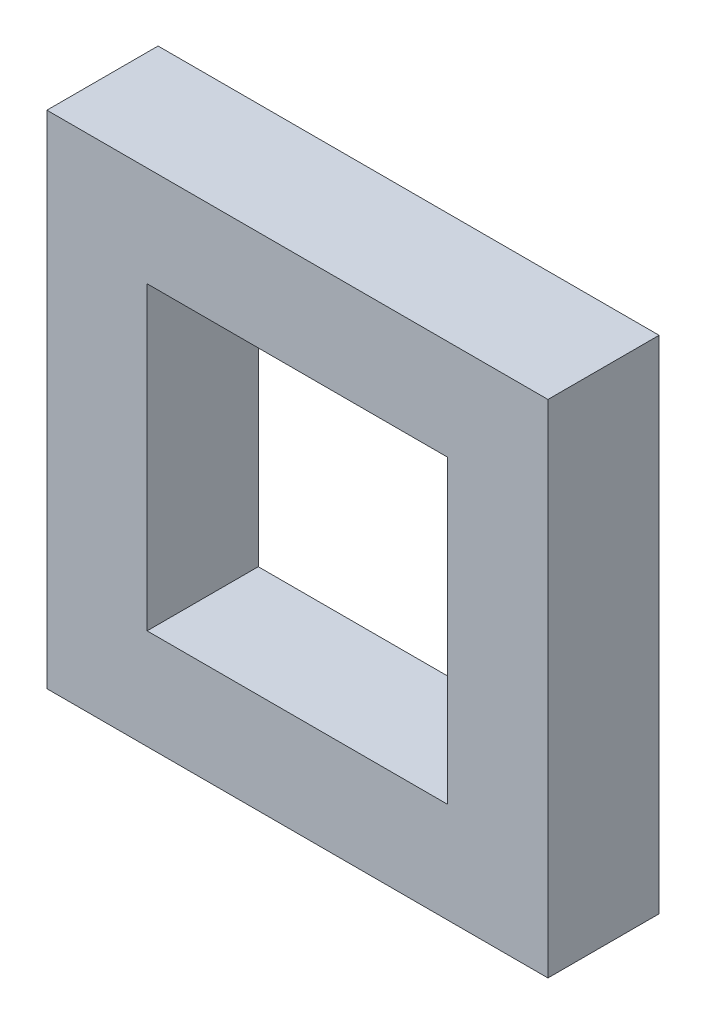
ISO-10303-21;
HEADER;
FILE_DESCRIPTION(('STEP AP214'),'2;1');
FILE_NAME('part.step','',(''),(''),'','','');
FILE_SCHEMA(('AUTOMOTIVE_DESIGN { 1 0 10303 214 1 1 1 1 }'));
ENDSEC;
DATA;
#1=APPLICATION_CONTEXT('core data for automotive mechanical design processes');
#2=APPLICATION_PROTOCOL_DEFINITION('international standard','automotive_design',2000,#1);
#3=PRODUCT_CONTEXT('',#1,'mechanical');
#4=PRODUCT('Part','Part','',(#3));
#5=PRODUCT_RELATED_PRODUCT_CATEGORY('part','',(#4));
#6=PRODUCT_DEFINITION_FORMATION('','',#4);
#7=PRODUCT_DEFINITION_CONTEXT('part definition',#1,'design');
#8=PRODUCT_DEFINITION('design','',#6,#7);
#9=PRODUCT_DEFINITION_SHAPE('','',#8);
#10=(LENGTH_UNIT() NAMED_UNIT(*) SI_UNIT(.MILLI.,.METRE.));
#11=(NAMED_UNIT(*) PLANE_ANGLE_UNIT() SI_UNIT($,.RADIAN.));
#12=(NAMED_UNIT(*) SI_UNIT($,.STERADIAN.) SOLID_ANGLE_UNIT());
#13=UNCERTAINTY_MEASURE_WITH_UNIT(LENGTH_MEASURE(1.E-05),#10,'distance_accuracy_value','');
#14=(GEOMETRIC_REPRESENTATION_CONTEXT(3) GLOBAL_UNCERTAINTY_ASSIGNED_CONTEXT((#13)) GLOBAL_UNIT_ASSIGNED_CONTEXT((#10,
#11,#12)) REPRESENTATION_CONTEXT('',''));
#15=CARTESIAN_POINT('',(0.,0.,0.));
#16=DIRECTION('',(0.,0.,1.));
#17=DIRECTION('',(1.,0.,0.));
#18=AXIS2_PLACEMENT_3D('',#15,#16,#17);
#19=CARTESIAN_POINT('',(0.396687201262181,9.82153319179582,0.15));
#20=DIRECTION('',(0.,-1.,0.));
#21=DIRECTION('',(0.,0.,-1.));
#22=AXIS2_PLACEMENT_3D('',#19,#20,#21);
#23=PLANE('',#22);
#24=DIRECTION('',(1.,0.,0.));
#25=VECTOR('',#24,1.);
#26=CARTESIAN_POINT('',(0.396687201262181,9.82153319179582,0.15));
#27=LINE('',#26,#25);
#28=CARTESIAN_POINT('',(0.396687201262181,9.82153319179582,0.15));
#29=VERTEX_POINT('',#28);
#30=CARTESIAN_POINT('',(0.694202602208818,9.82153319179582,0.15));
#31=VERTEX_POINT('',#30);
#32=EDGE_CURVE('E130',#29,#31,#27,.T.);
#33=ORIENTED_EDGE('',*,*,#32,.T.);
#34=DIRECTION('',(0.,0.,1.));
#35=VECTOR('',#34,1.);
#36=CARTESIAN_POINT('',(0.694202602208818,9.82153319179582,0.15));
#37=LINE('',#36,#35);
#38=CARTESIAN_POINT('',(0.694202602208818,9.82153319179582,0.26));
#39=VERTEX_POINT('',#38);
#40=EDGE_CURVE('E91',#31,#39,#37,.T.);
#41=ORIENTED_EDGE('',*,*,#40,.T.);
#42=DIRECTION('',(1.,0.,0.));
#43=VECTOR('',#42,1.);
#44=CARTESIAN_POINT('',(0.396687201262181,9.82153319179582,0.26));
#45=LINE('',#44,#43);
#46=CARTESIAN_POINT('',(0.396687201262181,9.82153319179582,0.26));
#47=VERTEX_POINT('',#46);
#48=EDGE_CURVE('E11',#47,#39,#45,.T.);
#49=ORIENTED_EDGE('',*,*,#48,.F.);
#50=DIRECTION('',(0.,0.,1.));
#51=VECTOR('',#50,1.);
#52=CARTESIAN_POINT('',(0.396687201262181,9.82153319179582,0.15));
#53=LINE('',#52,#51);
#54=EDGE_CURVE('E88',#29,#47,#53,.T.);
#55=ORIENTED_EDGE('',*,*,#54,.F.);
#56=EDGE_LOOP('',(#33,#41,#49,#55));
#57=FACE_BOUND('',#56,.T.);
#58=ADVANCED_FACE('F16',(#57),#23,.T.);
#59=CARTESIAN_POINT('',(0.5454449017355,9.6727754913225,0.26));
#60=DIRECTION('',(0.,0.,1.));
#61=DIRECTION('',(1.,0.,0.));
#62=AXIS2_PLACEMENT_3D('',#59,#60,#61);
#63=PLANE('',#62);
#64=DIRECTION('',(-1.,0.,0.));
#65=VECTOR('',#64,1.);
#66=CARTESIAN_POINT('',(0.694202602208818,9.52401779084918,0.26));
#67=LINE('',#66,#65);
#68=CARTESIAN_POINT('',(0.694202602208818,9.52401779084918,0.26));
#69=VERTEX_POINT('',#68);
#70=CARTESIAN_POINT('',(0.396687201262181,9.52401779084918,0.26));
#71=VERTEX_POINT('',#70);
#72=EDGE_CURVE('E98',#69,#71,#67,.T.);
#73=ORIENTED_EDGE('',*,*,#72,.T.);
#74=DIRECTION('',(0.,1.,0.));
#75=VECTOR('',#74,1.);
#76=CARTESIAN_POINT('',(0.396687201262181,9.52401779084918,0.26));
#77=LINE('',#76,#75);
#78=EDGE_CURVE('E96',#71,#47,#77,.T.);
#79=ORIENTED_EDGE('',*,*,#78,.T.);
#80=ORIENTED_EDGE('',*,*,#48,.T.);
#81=DIRECTION('',(0.,-1.,0.));
#82=VECTOR('',#81,1.);
#83=CARTESIAN_POINT('',(0.694202602208818,9.82153319179582,0.26));
#84=LINE('',#83,#82);
#85=EDGE_CURVE('E163',#39,#69,#84,.T.);
#86=ORIENTED_EDGE('',*,*,#85,.T.);
#87=EDGE_LOOP('',(#73,#79,#80,#86));
#88=FACE_BOUND('',#87,.T.);
#89=DIRECTION('',(-1.,0.,0.));
#90=VECTOR('',#89,1.);
#91=CARTESIAN_POINT('',(0.297515400946636,9.92070499211137,0.26));
#92=LINE('',#91,#90);
#93=CARTESIAN_POINT('',(0.793374402524363,9.92070499211137,0.26));
#94=VERTEX_POINT('',#93);
#95=CARTESIAN_POINT('',(0.297515400946636,9.92070499211137,0.26));
#96=VERTEX_POINT('',#95);
#97=EDGE_CURVE('E27',#94,#96,#92,.T.);
#98=ORIENTED_EDGE('',*,*,#97,.T.);
#99=DIRECTION('',(0.,-1.,0.));
#100=VECTOR('',#99,1.);
#101=CARTESIAN_POINT('',(0.297515400946636,9.42484599053364,0.26));
#102=LINE('',#101,#100);
#103=CARTESIAN_POINT('',(0.297515400946636,9.42484599053364,0.26));
#104=VERTEX_POINT('',#103);
#105=EDGE_CURVE('E154',#96,#104,#102,.T.);
#106=ORIENTED_EDGE('',*,*,#105,.T.);
#107=DIRECTION('',(1.,0.,0.));
#108=VECTOR('',#107,1.);
#109=CARTESIAN_POINT('',(0.793374402524363,9.42484599053364,0.26));
#110=LINE('',#109,#108);
#111=CARTESIAN_POINT('',(0.793374402524363,9.42484599053364,0.26));
#112=VERTEX_POINT('',#111);
#113=EDGE_CURVE('E77',#104,#112,#110,.T.);
#114=ORIENTED_EDGE('',*,*,#113,.T.);
#115=DIRECTION('',(0.,1.,0.));
#116=VECTOR('',#115,1.);
#117=CARTESIAN_POINT('',(0.793374402524363,9.92070499211137,0.26));
#118=LINE('',#117,#116);
#119=EDGE_CURVE('E116',#112,#94,#118,.T.);
#120=ORIENTED_EDGE('',*,*,#119,.T.);
#121=EDGE_LOOP('',(#98,#106,#114,#120));
#122=FACE_BOUND('',#121,.T.);
#123=ADVANCED_FACE('F18',(#88,#122),#63,.T.);
#124=CARTESIAN_POINT('',(0.793374402524363,9.92070499211137,0.15));
#125=DIRECTION('',(0.,1.,0.));
#126=DIRECTION('',(1.,0.,0.));
#127=AXIS2_PLACEMENT_3D('',#124,#125,#126);
#128=PLANE('',#127);
#129=DIRECTION('',(1.,0.,0.));
#130=VECTOR('',#129,1.);
#131=CARTESIAN_POINT('',(0.297515400946636,9.92070499211137,0.15));
#132=LINE('',#131,#130);
#133=CARTESIAN_POINT('',(0.297515400946636,9.92070499211137,0.15));
#134=VERTEX_POINT('',#133);
#135=CARTESIAN_POINT('',(0.793374402524363,9.92070499211137,0.15));
#136=VERTEX_POINT('',#135);
#137=EDGE_CURVE('E125',#134,#136,#132,.T.);
#138=ORIENTED_EDGE('',*,*,#137,.F.);
#139=DIRECTION('',(0.,0.,1.));
#140=VECTOR('',#139,1.);
#141=CARTESIAN_POINT('',(0.297515400946636,9.92070499211137,0.15));
#142=LINE('',#141,#140);
#143=EDGE_CURVE('E157',#134,#96,#142,.T.);
#144=ORIENTED_EDGE('',*,*,#143,.T.);
#145=ORIENTED_EDGE('',*,*,#97,.F.);
#146=DIRECTION('',(0.,0.,1.));
#147=VECTOR('',#146,1.);
#148=CARTESIAN_POINT('',(0.793374402524363,9.92070499211137,0.15));
#149=LINE('',#148,#147);
#150=EDGE_CURVE('E120',#136,#94,#149,.T.);
#151=ORIENTED_EDGE('',*,*,#150,.F.);
#152=EDGE_LOOP('',(#138,#144,#145,#151));
#153=FACE_BOUND('',#152,.T.);
#154=ADVANCED_FACE('F206',(#153),#128,.T.);
#155=CARTESIAN_POINT('',(0.297515400946636,9.92070499211137,0.15));
#156=DIRECTION('',(-1.,0.,0.));
#157=DIRECTION('',(0.,0.,1.));
#158=AXIS2_PLACEMENT_3D('',#155,#156,#157);
#159=PLANE('',#158);
#160=DIRECTION('',(0.,1.,0.));
#161=VECTOR('',#160,1.);
#162=CARTESIAN_POINT('',(0.297515400946636,9.42484599053364,0.15));
#163=LINE('',#162,#161);
#164=CARTESIAN_POINT('',(0.297515400946636,9.42484599053364,0.15));
#165=VERTEX_POINT('',#164);
#166=EDGE_CURVE('E138',#165,#134,#163,.T.);
#167=ORIENTED_EDGE('',*,*,#166,.F.);
#168=DIRECTION('',(0.,0.,1.));
#169=VECTOR('',#168,1.);
#170=CARTESIAN_POINT('',(0.297515400946636,9.42484599053364,0.15));
#171=LINE('',#170,#169);
#172=EDGE_CURVE('E150',#165,#104,#171,.T.);
#173=ORIENTED_EDGE('',*,*,#172,.T.);
#174=ORIENTED_EDGE('',*,*,#105,.F.);
#175=ORIENTED_EDGE('',*,*,#143,.F.);
#176=EDGE_LOOP('',(#167,#173,#174,#175));
#177=FACE_BOUND('',#176,.T.);
#178=ADVANCED_FACE('F211',(#177),#159,.T.);
#179=CARTESIAN_POINT('',(0.297515400946636,9.42484599053364,0.15));
#180=DIRECTION('',(0.,-1.,0.));
#181=DIRECTION('',(0.,0.,-1.));
#182=AXIS2_PLACEMENT_3D('',#179,#180,#181);
#183=PLANE('',#182);
#184=DIRECTION('',(-1.,0.,0.));
#185=VECTOR('',#184,1.);
#186=CARTESIAN_POINT('',(0.793374402524363,9.42484599053364,0.15));
#187=LINE('',#186,#185);
#188=CARTESIAN_POINT('',(0.793374402524363,9.42484599053364,0.15));
#189=VERTEX_POINT('',#188);
#190=EDGE_CURVE('E20',#189,#165,#187,.T.);
#191=ORIENTED_EDGE('',*,*,#190,.F.);
#192=DIRECTION('',(0.,0.,1.));
#193=VECTOR('',#192,1.);
#194=CARTESIAN_POINT('',(0.793374402524363,9.42484599053364,0.15));
#195=LINE('',#194,#193);
#196=EDGE_CURVE('E108',#189,#112,#195,.T.);
#197=ORIENTED_EDGE('',*,*,#196,.T.);
#198=ORIENTED_EDGE('',*,*,#113,.F.);
#199=ORIENTED_EDGE('',*,*,#172,.F.);
#200=EDGE_LOOP('',(#191,#197,#198,#199));
#201=FACE_BOUND('',#200,.T.);
#202=ADVANCED_FACE('F221',(#201),#183,.T.);
#203=CARTESIAN_POINT('',(0.396687201262181,9.52401779084918,0.15));
#204=DIRECTION('',(1.,0.,0.));
#205=DIRECTION('',(0.,1.,0.));
#206=AXIS2_PLACEMENT_3D('',#203,#204,#205);
#207=PLANE('',#206);
#208=DIRECTION('',(0.,1.,0.));
#209=VECTOR('',#208,1.);
#210=CARTESIAN_POINT('',(0.396687201262181,9.52401779084918,0.15));
#211=LINE('',#210,#209);
#212=CARTESIAN_POINT('',(0.396687201262181,9.52401779084918,0.15));
#213=VERTEX_POINT('',#212);
#214=EDGE_CURVE('E105',#213,#29,#211,.T.);
#215=ORIENTED_EDGE('',*,*,#214,.T.);
#216=ORIENTED_EDGE('',*,*,#54,.T.);
#217=ORIENTED_EDGE('',*,*,#78,.F.);
#218=DIRECTION('',(0.,0.,1.));
#219=VECTOR('',#218,1.);
#220=CARTESIAN_POINT('',(0.396687201262181,9.52401779084918,0.15));
#221=LINE('',#220,#219);
#222=EDGE_CURVE('E124',#213,#71,#221,.T.);
#223=ORIENTED_EDGE('',*,*,#222,.F.);
#224=EDGE_LOOP('',(#215,#216,#217,#223));
#225=FACE_BOUND('',#224,.T.);
#226=ADVANCED_FACE('F103',(#225),#207,.T.);
#227=CARTESIAN_POINT('',(0.793374402524363,9.42484599053364,0.15));
#228=DIRECTION('',(1.,0.,0.));
#229=DIRECTION('',(0.,-1.,0.));
#230=AXIS2_PLACEMENT_3D('',#227,#228,#229);
#231=PLANE('',#230);
#232=DIRECTION('',(0.,-1.,0.));
#233=VECTOR('',#232,1.);
#234=CARTESIAN_POINT('',(0.793374402524363,9.92070499211137,0.15));
#235=LINE('',#234,#233);
#236=EDGE_CURVE('E129',#136,#189,#235,.T.);
#237=ORIENTED_EDGE('',*,*,#236,.F.);
#238=ORIENTED_EDGE('',*,*,#150,.T.);
#239=ORIENTED_EDGE('',*,*,#119,.F.);
#240=ORIENTED_EDGE('',*,*,#196,.F.);
#241=EDGE_LOOP('',(#237,#238,#239,#240));
#242=FACE_BOUND('',#241,.T.);
#243=ADVANCED_FACE('F245',(#242),#231,.T.);
#244=CARTESIAN_POINT('',(0.694202602208818,9.52401779084918,0.15));
#245=DIRECTION('',(0.,1.,0.));
#246=DIRECTION('',(1.,0.,0.));
#247=AXIS2_PLACEMENT_3D('',#244,#245,#246);
#248=PLANE('',#247);
#249=DIRECTION('',(-1.,0.,0.));
#250=VECTOR('',#249,1.);
#251=CARTESIAN_POINT('',(0.694202602208818,9.52401779084918,0.15));
#252=LINE('',#251,#250);
#253=CARTESIAN_POINT('',(0.694202602208818,9.52401779084918,0.15));
#254=VERTEX_POINT('',#253);
#255=EDGE_CURVE('E133',#254,#213,#252,.T.);
#256=ORIENTED_EDGE('',*,*,#255,.T.);
#257=ORIENTED_EDGE('',*,*,#222,.T.);
#258=ORIENTED_EDGE('',*,*,#72,.F.);
#259=DIRECTION('',(0.,0.,1.));
#260=VECTOR('',#259,1.);
#261=CARTESIAN_POINT('',(0.694202602208818,9.52401779084918,0.15));
#262=LINE('',#261,#260);
#263=EDGE_CURVE('E149',#254,#69,#262,.T.);
#264=ORIENTED_EDGE('',*,*,#263,.F.);
#265=EDGE_LOOP('',(#256,#257,#258,#264));
#266=FACE_BOUND('',#265,.T.);
#267=ADVANCED_FACE('F258',(#266),#248,.T.);
#268=CARTESIAN_POINT('',(0.5454449017355,9.6727754913225,0.15));
#269=DIRECTION('',(0.,0.,1.));
#270=DIRECTION('',(1.,0.,0.));
#271=AXIS2_PLACEMENT_3D('',#268,#269,#270);
#272=PLANE('',#271);
#273=ORIENTED_EDGE('',*,*,#255,.F.);
#274=DIRECTION('',(0.,-1.,0.));
#275=VECTOR('',#274,1.);
#276=CARTESIAN_POINT('',(0.694202602208818,9.82153319179582,0.15));
#277=LINE('',#276,#275);
#278=EDGE_CURVE('E145',#31,#254,#277,.T.);
#279=ORIENTED_EDGE('',*,*,#278,.F.);
#280=ORIENTED_EDGE('',*,*,#32,.F.);
#281=ORIENTED_EDGE('',*,*,#214,.F.);
#282=EDGE_LOOP('',(#273,#279,#280,#281));
#283=FACE_BOUND('',#282,.T.);
#284=ORIENTED_EDGE('',*,*,#137,.T.);
#285=ORIENTED_EDGE('',*,*,#236,.T.);
#286=ORIENTED_EDGE('',*,*,#190,.T.);
#287=ORIENTED_EDGE('',*,*,#166,.T.);
#288=EDGE_LOOP('',(#284,#285,#286,#287));
#289=FACE_BOUND('',#288,.T.);
#290=ADVANCED_FACE('F252',(#283,#289),#272,.F.);
#291=CARTESIAN_POINT('',(0.694202602208818,9.82153319179582,0.15));
#292=DIRECTION('',(-1.,0.,0.));
#293=DIRECTION('',(0.,0.,1.));
#294=AXIS2_PLACEMENT_3D('',#291,#292,#293);
#295=PLANE('',#294);
#296=ORIENTED_EDGE('',*,*,#278,.T.);
#297=ORIENTED_EDGE('',*,*,#263,.T.);
#298=ORIENTED_EDGE('',*,*,#85,.F.);
#299=ORIENTED_EDGE('',*,*,#40,.F.);
#300=EDGE_LOOP('',(#296,#297,#298,#299));
#301=FACE_BOUND('',#300,.T.);
#302=ADVANCED_FACE('F257',(#301),#295,.T.);
#303=CLOSED_SHELL('',(#58,#123,#154,#178,#202,#226,#243,#267,#290,#302));
#304=MANIFOLD_SOLID_BREP('B1',#303);
#305=ADVANCED_BREP_SHAPE_REPRESENTATION('',(#18,#304),#14);
#306=SHAPE_DEFINITION_REPRESENTATION(#9,#305);
ENDSEC;
END-ISO-10303-21;
